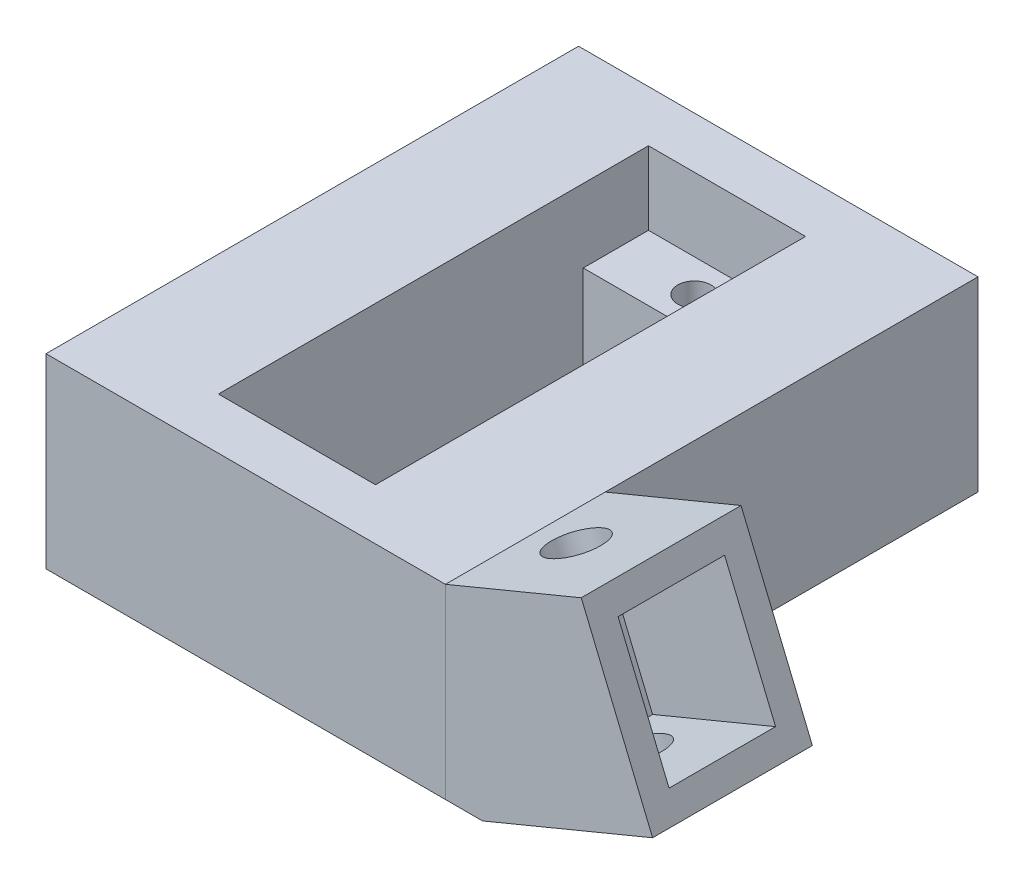
ISO-10303-21;
HEADER;
FILE_DESCRIPTION(('STEP AP214'),'2;1');
FILE_NAME('part.step','',(''),(''),'','','');
FILE_SCHEMA(('AUTOMOTIVE_DESIGN { 1 0 10303 214 1 1 1 1 }'));
ENDSEC;
DATA;
#1=APPLICATION_CONTEXT('core data for automotive mechanical design processes');
#2=APPLICATION_PROTOCOL_DEFINITION('international standard','automotive_design',2000,#1);
#3=PRODUCT_CONTEXT('',#1,'mechanical');
#4=PRODUCT('Part','Part','',(#3));
#5=PRODUCT_RELATED_PRODUCT_CATEGORY('part','',(#4));
#6=PRODUCT_DEFINITION_FORMATION('','',#4);
#7=PRODUCT_DEFINITION_CONTEXT('part definition',#1,'design');
#8=PRODUCT_DEFINITION('design','',#6,#7);
#9=PRODUCT_DEFINITION_SHAPE('','',#8);
#10=(LENGTH_UNIT() NAMED_UNIT(*) SI_UNIT(.MILLI.,.METRE.));
#11=(NAMED_UNIT(*) PLANE_ANGLE_UNIT() SI_UNIT($,.RADIAN.));
#12=(NAMED_UNIT(*) SI_UNIT($,.STERADIAN.) SOLID_ANGLE_UNIT());
#13=UNCERTAINTY_MEASURE_WITH_UNIT(LENGTH_MEASURE(1.E-05),#10,'distance_accuracy_value','');
#14=(GEOMETRIC_REPRESENTATION_CONTEXT(3) GLOBAL_UNCERTAINTY_ASSIGNED_CONTEXT((#13)) GLOBAL_UNIT_ASSIGNED_CONTEXT((#10,
#11,#12)) REPRESENTATION_CONTEXT('',''));
#15=CARTESIAN_POINT('',(0.,0.,0.));
#16=DIRECTION('',(0.,0.,1.));
#17=DIRECTION('',(1.,0.,0.));
#18=AXIS2_PLACEMENT_3D('',#15,#16,#17);
#19=CARTESIAN_POINT('',(6.59982399774752,24.7982922199653,34.));
#20=DIRECTION('',(0.382683432365084,-0.923879532511289,0.));
#21=DIRECTION('',(0.923879532511289,0.382683432365084,0.));
#22=AXIS2_PLACEMENT_3D('',#19,#20,#21);
#23=CYLINDRICAL_SURFACE('',#22,2.);
#24=CARTESIAN_POINT('',(17.0796064724433,-0.502140761165466,34.));
#25=DIRECTION('',(0.382683432365093,-0.923879532511286,0.));
#26=DIRECTION('',(0.923879532511286,0.382683432365093,0.));
#27=AXIS2_PLACEMENT_3D('',#24,#25,#26);
#28=CIRCLE('',#27,2.);
#29=CARTESIAN_POINT('',(18.9273655374658,0.263226103564719,34.));
#30=VERTEX_POINT('',#29);
#31=EDGE_CURVE('E52',#30,#30,#28,.F.);
#32=ORIENTED_EDGE('',*,*,#31,.T.);
#33=EDGE_LOOP('',(#32));
#34=FACE_BOUND('',#33,.T.);
#35=CARTESIAN_POINT('',(17.8449733371734,-2.34989982618799,34.));
#36=DIRECTION('',(0.382683432365084,-0.923879532511289,0.));
#37=DIRECTION('',(0.923879532511289,0.382683432365084,0.));
#38=AXIS2_PLACEMENT_3D('',#35,#36,#37);
#39=CIRCLE('',#38,2.);
#40=CARTESIAN_POINT('',(19.692732402196,-1.58453296145782,34.));
#41=VERTEX_POINT('',#40);
#42=EDGE_CURVE('E153',#41,#41,#39,.T.);
#43=ORIENTED_EDGE('',*,*,#42,.T.);
#44=EDGE_LOOP('',(#43));
#45=FACE_BOUND('',#44,.T.);
#46=ADVANCED_FACE('F48',(#34,#45),#23,.F.);
#47=CARTESIAN_POINT('',(24.2314403727898,0.295461435612971,28.));
#48=DIRECTION('',(0.382683432365084,-0.923879532511289,0.));
#49=DIRECTION('',(0.923879532511289,0.382683432365084,0.));
#50=AXIS2_PLACEMENT_3D('',#47,#48,#49);
#51=PLANE('',#50);
#52=ORIENTED_EDGE('',*,*,#42,.F.);
#53=EDGE_LOOP('',(#52));
#54=FACE_BOUND('',#53,.T.);
#55=DIRECTION('',(0.923879532511289,0.382683432365084,0.));
#56=VECTOR('',#55,1.);
#57=CARTESIAN_POINT('',(24.2314403727898,0.295461435612971,40.));
#58=LINE('',#57,#56);
#59=CARTESIAN_POINT('',(11.458506301557,-4.99526108798895,40.));
#60=VERTEX_POINT('',#59);
#61=CARTESIAN_POINT('',(24.2314403727898,0.295461435612971,40.));
#62=VERTEX_POINT('',#61);
#63=EDGE_CURVE('E146',#60,#62,#58,.T.);
#64=ORIENTED_EDGE('',*,*,#63,.F.);
#65=DIRECTION('',(0.,0.,1.));
#66=VECTOR('',#65,1.);
#67=CARTESIAN_POINT('',(11.458506301557,-4.99526108798895,28.));
#68=LINE('',#67,#66);
#69=CARTESIAN_POINT('',(11.458506301557,-4.99526108798895,28.));
#70=VERTEX_POINT('',#69);
#71=EDGE_CURVE('E57',#70,#60,#68,.T.);
#72=ORIENTED_EDGE('',*,*,#71,.F.);
#73=DIRECTION('',(0.923879532511289,0.382683432365084,0.));
#74=VECTOR('',#73,1.);
#75=CARTESIAN_POINT('',(24.2314403727898,0.295461435612971,28.));
#76=LINE('',#75,#74);
#77=CARTESIAN_POINT('',(24.2314403727898,0.295461435612971,28.));
#78=VERTEX_POINT('',#77);
#79=EDGE_CURVE('E128',#70,#78,#76,.T.);
#80=ORIENTED_EDGE('',*,*,#79,.T.);
#81=DIRECTION('',(0.,0.,1.));
#82=VECTOR('',#81,1.);
#83=CARTESIAN_POINT('',(24.2314403727898,0.295461435612971,28.));
#84=LINE('',#83,#82);
#85=EDGE_CURVE('E12',#78,#62,#84,.T.);
#86=ORIENTED_EDGE('',*,*,#85,.T.);
#87=EDGE_LOOP('',(#64,#72,#80,#86));
#88=FACE_BOUND('',#87,.T.);
#89=ADVANCED_FACE('F181',(#54,#88),#51,.T.);
#90=CARTESIAN_POINT('',(11.458506301557,-4.99526108798895,28.));
#91=DIRECTION('',(0.,-1.,0.));
#92=DIRECTION('',(1.,0.,0.));
#93=AXIS2_PLACEMENT_3D('',#90,#91,#92);
#94=PLANE('',#93);
#95=DIRECTION('',(1.,0.,0.));
#96=VECTOR('',#95,1.);
#97=CARTESIAN_POINT('',(11.458506301557,-4.99526108798895,40.));
#98=LINE('',#97,#96);
#99=CARTESIAN_POINT('',(8.67095256505801,-4.99526108798895,40.));
#100=VERTEX_POINT('',#99);
#101=EDGE_CURVE('E114',#100,#60,#98,.T.);
#102=ORIENTED_EDGE('',*,*,#101,.F.);
#103=DIRECTION('',(0.,0.,1.));
#104=VECTOR('',#103,1.);
#105=CARTESIAN_POINT('',(8.67095256505801,-4.99526108798895,28.));
#106=LINE('',#105,#104);
#107=CARTESIAN_POINT('',(8.67095256505801,-4.99526108798895,28.));
#108=VERTEX_POINT('',#107);
#109=EDGE_CURVE('E108',#108,#100,#106,.T.);
#110=ORIENTED_EDGE('',*,*,#109,.F.);
#111=DIRECTION('',(1.,0.,0.));
#112=VECTOR('',#111,1.);
#113=CARTESIAN_POINT('',(11.458506301557,-4.99526108798895,28.));
#114=LINE('',#113,#112);
#115=EDGE_CURVE('E111',#108,#70,#114,.T.);
#116=ORIENTED_EDGE('',*,*,#115,.T.);
#117=ORIENTED_EDGE('',*,*,#71,.T.);
#118=EDGE_LOOP('',(#102,#110,#116,#117));
#119=FACE_BOUND('',#118,.T.);
#120=ADVANCED_FACE('F110',(#119),#94,.T.);
#121=CARTESIAN_POINT('',(8.67095256505801,9.00358715260278,28.));
#122=DIRECTION('',(-1.,0.,0.));
#123=DIRECTION('',(0.,0.,1.));
#124=AXIS2_PLACEMENT_3D('',#121,#122,#123);
#125=PLANE('',#124);
#126=DIRECTION('',(0.,-1.,0.));
#127=VECTOR('',#126,1.);
#128=CARTESIAN_POINT('',(8.67095256505801,9.00358715260278,40.));
#129=LINE('',#128,#127);
#130=CARTESIAN_POINT('',(8.67095256505801,9.00358715260278,40.));
#131=VERTEX_POINT('',#130);
#132=EDGE_CURVE('E143',#131,#100,#129,.T.);
#133=ORIENTED_EDGE('',*,*,#132,.F.);
#134=DIRECTION('',(0.,0.,1.));
#135=VECTOR('',#134,1.);
#136=CARTESIAN_POINT('',(8.67095256505801,9.00358715260278,28.));
#137=LINE('',#136,#135);
#138=CARTESIAN_POINT('',(8.67095256505801,9.00358715260278,28.));
#139=VERTEX_POINT('',#138);
#140=EDGE_CURVE('E119',#139,#131,#137,.T.);
#141=ORIENTED_EDGE('',*,*,#140,.F.);
#142=DIRECTION('',(0.,-1.,0.));
#143=VECTOR('',#142,1.);
#144=CARTESIAN_POINT('',(8.67095256505801,9.00358715260278,28.));
#145=LINE('',#144,#143);
#146=EDGE_CURVE('E125',#139,#108,#145,.T.);
#147=ORIENTED_EDGE('',*,*,#146,.T.);
#148=ORIENTED_EDGE('',*,*,#109,.T.);
#149=EDGE_LOOP('',(#133,#141,#147,#148));
#150=FACE_BOUND('',#149,.T.);
#151=ADVANCED_FACE('F130',(#150),#125,.T.);
#152=CARTESIAN_POINT('',(18.8738723196785,13.229774890771,28.));
#153=DIRECTION('',(-0.382683432365093,0.923879532511285,0.));
#154=DIRECTION('',(-0.923879532511286,-0.382683432365093,0.));
#155=AXIS2_PLACEMENT_3D('',#152,#153,#154);
#156=PLANE('',#155);
#157=CARTESIAN_POINT('',(12.4874052840622,10.58441362897,34.));
#158=DIRECTION('',(-0.382683432365093,0.923879532511285,0.));
#159=DIRECTION('',(-0.923879532511286,-0.382683432365093,0.));
#160=AXIS2_PLACEMENT_3D('',#157,#158,#159);
#161=CIRCLE('',#160,2.);
#162=CARTESIAN_POINT('',(10.6396462190397,9.81904676423984,34.));
#163=VERTEX_POINT('',#162);
#164=EDGE_CURVE('E140',#163,#163,#161,.T.);
#165=ORIENTED_EDGE('',*,*,#164,.F.);
#166=EDGE_LOOP('',(#165));
#167=FACE_BOUND('',#166,.T.);
#168=DIRECTION('',(-0.923879532511285,-0.382683432365093,0.));
#169=VECTOR('',#168,1.);
#170=CARTESIAN_POINT('',(18.8738723196785,13.229774890771,40.));
#171=LINE('',#170,#169);
#172=CARTESIAN_POINT('',(18.8738723196785,13.229774890771,40.));
#173=VERTEX_POINT('',#172);
#174=EDGE_CURVE('E139',#173,#131,#171,.T.);
#175=ORIENTED_EDGE('',*,*,#174,.F.);
#176=DIRECTION('',(0.,0.,1.));
#177=VECTOR('',#176,1.);
#178=CARTESIAN_POINT('',(18.8738723196785,13.229774890771,28.));
#179=LINE('',#178,#177);
#180=CARTESIAN_POINT('',(18.8738723196785,13.229774890771,28.));
#181=VERTEX_POINT('',#180);
#182=EDGE_CURVE('E137',#181,#173,#179,.T.);
#183=ORIENTED_EDGE('',*,*,#182,.F.);
#184=DIRECTION('',(-0.923879532511285,-0.382683432365093,0.));
#185=VECTOR('',#184,1.);
#186=CARTESIAN_POINT('',(18.8738723196785,13.229774890771,28.));
#187=LINE('',#186,#185);
#188=EDGE_CURVE('E131',#181,#139,#187,.T.);
#189=ORIENTED_EDGE('',*,*,#188,.T.);
#190=ORIENTED_EDGE('',*,*,#140,.T.);
#191=EDGE_LOOP('',(#175,#183,#189,#190));
#192=FACE_BOUND('',#191,.T.);
#193=ADVANCED_FACE('F190',(#167,#192),#156,.T.);
#194=CARTESIAN_POINT('',(20.7872894815039,8.61037722821456,28.));
#195=DIRECTION('',(0.923879532511285,0.382683432365093,0.));
#196=DIRECTION('',(-0.382683432365093,0.923879532511286,0.));
#197=AXIS2_PLACEMENT_3D('',#194,#195,#196);
#198=PLANE('',#197);
#199=DIRECTION('',(-0.382683432365093,0.923879532511286,0.));
#200=VECTOR('',#199,1.);
#201=CARTESIAN_POINT('',(23.4660735080596,2.14322050063554,30.));
#202=LINE('',#201,#200);
#203=CARTESIAN_POINT('',(23.4660735080596,2.14322050063554,30.));
#204=VERTEX_POINT('',#203);
#205=CARTESIAN_POINT('',(19.6392391844087,11.3820158257484,30.));
#206=VERTEX_POINT('',#205);
#207=EDGE_CURVE('E65',#204,#206,#202,.T.);
#208=ORIENTED_EDGE('',*,*,#207,.F.);
#209=DIRECTION('',(0.,0.,-1.));
#210=VECTOR('',#209,1.);
#211=CARTESIAN_POINT('',(23.4660735080596,2.14322050063554,30.));
#212=LINE('',#211,#210);
#213=CARTESIAN_POINT('',(23.4660735080596,2.14322050063554,38.));
#214=VERTEX_POINT('',#213);
#215=EDGE_CURVE('E169',#214,#204,#212,.T.);
#216=ORIENTED_EDGE('',*,*,#215,.F.);
#217=DIRECTION('',(0.382683432365093,-0.923879532511286,0.));
#218=VECTOR('',#217,1.);
#219=CARTESIAN_POINT('',(23.4660735080596,2.14322050063554,38.));
#220=LINE('',#219,#218);
#221=CARTESIAN_POINT('',(19.6392391844087,11.3820158257484,38.));
#222=VERTEX_POINT('',#221);
#223=EDGE_CURVE('E328',#222,#214,#220,.T.);
#224=ORIENTED_EDGE('',*,*,#223,.F.);
#225=DIRECTION('',(0.,0.,1.));
#226=VECTOR('',#225,1.);
#227=CARTESIAN_POINT('',(19.6392391844087,11.3820158257484,30.));
#228=LINE('',#227,#226);
#229=EDGE_CURVE('E333',#206,#222,#228,.T.);
#230=ORIENTED_EDGE('',*,*,#229,.F.);
#231=EDGE_LOOP('',(#208,#216,#224,#230));
#232=FACE_BOUND('',#231,.T.);
#233=DIRECTION('',(-0.382683432365093,0.923879532511286,0.));
#234=VECTOR('',#233,1.);
#235=CARTESIAN_POINT('',(20.7872894815039,8.61037722821456,40.));
#236=LINE('',#235,#234);
#237=EDGE_CURVE('E94',#62,#173,#236,.T.);
#238=ORIENTED_EDGE('',*,*,#237,.F.);
#239=ORIENTED_EDGE('',*,*,#85,.F.);
#240=DIRECTION('',(-0.382683432365093,0.923879532511285,0.));
#241=VECTOR('',#240,1.);
#242=CARTESIAN_POINT('',(20.7872894815039,8.61037722821456,28.));
#243=LINE('',#242,#241);
#244=EDGE_CURVE('E97',#78,#181,#243,.T.);
#245=ORIENTED_EDGE('',*,*,#244,.T.);
#246=ORIENTED_EDGE('',*,*,#182,.T.);
#247=EDGE_LOOP('',(#238,#239,#245,#246));
#248=FACE_BOUND('',#247,.T.);
#249=ADVANCED_FACE('F50',(#232,#248),#198,.T.);
#250=CARTESIAN_POINT('',(0.,0.,28.));
#251=DIRECTION('',(0.,0.,-1.));
#252=DIRECTION('',(-1.,0.,0.));
#253=AXIS2_PLACEMENT_3D('',#250,#251,#252);
#254=PLANE('',#253);
#255=ORIENTED_EDGE('',*,*,#244,.F.);
#256=ORIENTED_EDGE('',*,*,#79,.F.);
#257=ORIENTED_EDGE('',*,*,#115,.F.);
#258=ORIENTED_EDGE('',*,*,#146,.F.);
#259=ORIENTED_EDGE('',*,*,#188,.F.);
#260=EDGE_LOOP('',(#255,#256,#257,#258,#259));
#261=FACE_BOUND('',#260,.T.);
#262=ADVANCED_FACE('F123',(#261),#254,.T.);
#263=CARTESIAN_POINT('',(0.,0.,40.));
#264=DIRECTION('',(0.,0.,-1.));
#265=DIRECTION('',(-1.,0.,0.));
#266=AXIS2_PLACEMENT_3D('',#263,#264,#265);
#267=PLANE('',#266);
#268=ORIENTED_EDGE('',*,*,#63,.T.);
#269=ORIENTED_EDGE('',*,*,#237,.T.);
#270=ORIENTED_EDGE('',*,*,#174,.T.);
#271=ORIENTED_EDGE('',*,*,#132,.T.);
#272=ORIENTED_EDGE('',*,*,#101,.T.);
#273=EDGE_LOOP('',(#268,#269,#270,#271,#272));
#274=FACE_BOUND('',#273,.T.);
#275=ADVANCED_FACE('F187',(#274),#267,.F.);
#276=CARTESIAN_POINT('',(13.2527721487924,8.73665456394744,34.));
#277=DIRECTION('',(-0.382683432365093,0.923879532511286,0.));
#278=DIRECTION('',(-0.923879532511286,-0.382683432365093,0.));
#279=AXIS2_PLACEMENT_3D('',#276,#277,#278);
#280=CIRCLE('',#279,2.);
#281=CARTESIAN_POINT('',(11.4050130837698,7.97128769921726,34.));
#282=VERTEX_POINT('',#281);
#283=EDGE_CURVE('E154',#282,#282,#280,.F.);
#284=ORIENTED_EDGE('',*,*,#283,.T.);
#285=EDGE_LOOP('',(#284));
#286=FACE_BOUND('',#285,.T.);
#287=ORIENTED_EDGE('',*,*,#164,.T.);
#288=EDGE_LOOP('',(#287));
#289=FACE_BOUND('',#288,.T.);
#290=ADVANCED_FACE('F204',(#286,#289),#23,.F.);
#291=CARTESIAN_POINT('',(14.2272781829467,-1.68361382301538,30.));
#292=DIRECTION('',(0.382683432365093,-0.923879532511286,0.));
#293=DIRECTION('',(0.923879532511286,0.382683432365093,0.));
#294=AXIS2_PLACEMENT_3D('',#291,#292,#293);
#295=PLANE('',#294);
#296=ORIENTED_EDGE('',*,*,#215,.T.);
#297=DIRECTION('',(0.923879532511286,0.382683432365093,0.));
#298=VECTOR('',#297,1.);
#299=CARTESIAN_POINT('',(14.2272781829467,-1.68361382301538,30.));
#300=LINE('',#299,#298);
#301=CARTESIAN_POINT('',(14.2272781829467,-1.68361382301538,30.));
#302=VERTEX_POINT('',#301);
#303=EDGE_CURVE('E156',#302,#204,#300,.T.);
#304=ORIENTED_EDGE('',*,*,#303,.F.);
#305=DIRECTION('',(0.,0.,-1.));
#306=VECTOR('',#305,1.);
#307=CARTESIAN_POINT('',(14.2272781829467,-1.68361382301538,30.));
#308=LINE('',#307,#306);
#309=CARTESIAN_POINT('',(14.2272781829467,-1.68361382301538,38.));
#310=VERTEX_POINT('',#309);
#311=EDGE_CURVE('E176',#310,#302,#308,.T.);
#312=ORIENTED_EDGE('',*,*,#311,.F.);
#313=DIRECTION('',(0.923879532511286,0.382683432365093,0.));
#314=VECTOR('',#313,1.);
#315=CARTESIAN_POINT('',(14.2272781829467,-1.68361382301538,38.));
#316=LINE('',#315,#314);
#317=EDGE_CURVE('E160',#310,#214,#316,.T.);
#318=ORIENTED_EDGE('',*,*,#317,.T.);
#319=EDGE_LOOP('',(#296,#304,#312,#318));
#320=FACE_BOUND('',#319,.T.);
#321=ORIENTED_EDGE('',*,*,#31,.F.);
#322=EDGE_LOOP('',(#321));
#323=FACE_BOUND('',#322,.T.);
#324=ADVANCED_FACE('F209',(#320,#323),#295,.F.);
#325=CARTESIAN_POINT('',(10.4004438592958,7.55518150209749,30.));
#326=DIRECTION('',(-0.382683432365093,0.923879532511286,0.));
#327=DIRECTION('',(-0.923879532511286,-0.382683432365093,0.));
#328=AXIS2_PLACEMENT_3D('',#325,#326,#327);
#329=PLANE('',#328);
#330=ORIENTED_EDGE('',*,*,#229,.T.);
#331=DIRECTION('',(0.923879532511286,0.382683432365093,0.));
#332=VECTOR('',#331,1.);
#333=CARTESIAN_POINT('',(10.4004438592958,7.55518150209749,38.));
#334=LINE('',#333,#332);
#335=CARTESIAN_POINT('',(10.4004438592958,7.55518150209749,38.));
#336=VERTEX_POINT('',#335);
#337=EDGE_CURVE('E166',#336,#222,#334,.T.);
#338=ORIENTED_EDGE('',*,*,#337,.F.);
#339=DIRECTION('',(0.,0.,1.));
#340=VECTOR('',#339,1.);
#341=CARTESIAN_POINT('',(10.4004438592958,7.55518150209749,30.));
#342=LINE('',#341,#340);
#343=CARTESIAN_POINT('',(10.4004438592958,7.55518150209749,30.));
#344=VERTEX_POINT('',#343);
#345=EDGE_CURVE('E322',#344,#336,#342,.T.);
#346=ORIENTED_EDGE('',*,*,#345,.F.);
#347=DIRECTION('',(0.923879532511286,0.382683432365093,0.));
#348=VECTOR('',#347,1.);
#349=CARTESIAN_POINT('',(10.4004438592958,7.55518150209749,30.));
#350=LINE('',#349,#348);
#351=EDGE_CURVE('E174',#344,#206,#350,.T.);
#352=ORIENTED_EDGE('',*,*,#351,.T.);
#353=EDGE_LOOP('',(#330,#338,#346,#352));
#354=FACE_BOUND('',#353,.T.);
#355=ORIENTED_EDGE('',*,*,#283,.F.);
#356=EDGE_LOOP('',(#355));
#357=FACE_BOUND('',#356,.T.);
#358=ADVANCED_FACE('F212',(#354,#357),#329,.F.);
#359=CARTESIAN_POINT('',(14.2272781829467,-1.68361382301538,30.));
#360=DIRECTION('',(0.,0.,-1.));
#361=DIRECTION('',(-1.,0.,0.));
#362=AXIS2_PLACEMENT_3D('',#359,#360,#361);
#363=PLANE('',#362);
#364=ORIENTED_EDGE('',*,*,#207,.T.);
#365=ORIENTED_EDGE('',*,*,#351,.F.);
#366=DIRECTION('',(-0.382683432365093,0.923879532511286,0.));
#367=VECTOR('',#366,1.);
#368=CARTESIAN_POINT('',(14.2272781829467,-1.68361382301538,30.));
#369=LINE('',#368,#367);
#370=EDGE_CURVE('E318',#302,#344,#369,.T.);
#371=ORIENTED_EDGE('',*,*,#370,.F.);
#372=ORIENTED_EDGE('',*,*,#303,.T.);
#373=EDGE_LOOP('',(#364,#365,#371,#372));
#374=FACE_BOUND('',#373,.T.);
#375=ADVANCED_FACE('F282',(#374),#363,.F.);
#376=CARTESIAN_POINT('',(14.2272781829467,-1.68361382301538,38.));
#377=DIRECTION('',(0.,0.,1.));
#378=DIRECTION('',(1.,0.,0.));
#379=AXIS2_PLACEMENT_3D('',#376,#377,#378);
#380=PLANE('',#379);
#381=ORIENTED_EDGE('',*,*,#223,.T.);
#382=ORIENTED_EDGE('',*,*,#317,.F.);
#383=DIRECTION('',(0.382683432365093,-0.923879532511286,0.));
#384=VECTOR('',#383,1.);
#385=CARTESIAN_POINT('',(14.2272781829467,-1.68361382301538,38.));
#386=LINE('',#385,#384);
#387=EDGE_CURVE('E326',#336,#310,#386,.T.);
#388=ORIENTED_EDGE('',*,*,#387,.F.);
#389=ORIENTED_EDGE('',*,*,#337,.T.);
#390=EDGE_LOOP('',(#381,#382,#388,#389));
#391=FACE_BOUND('',#390,.T.);
#392=ADVANCED_FACE('F291',(#391),#380,.F.);
#393=CARTESIAN_POINT('',(11.5484941563911,4.78354290456367,0.));
#394=DIRECTION('',(0.923879532511286,0.382683432365093,0.));
#395=DIRECTION('',(-0.382683432365093,0.923879532511286,0.));
#396=AXIS2_PLACEMENT_3D('',#393,#394,#395);
#397=PLANE('',#396);
#398=ORIENTED_EDGE('',*,*,#370,.T.);
#399=ORIENTED_EDGE('',*,*,#345,.T.);
#400=ORIENTED_EDGE('',*,*,#387,.T.);
#401=ORIENTED_EDGE('',*,*,#311,.T.);
#402=EDGE_LOOP('',(#398,#399,#400,#401));
#403=FACE_BOUND('',#402,.T.);
#404=ADVANCED_FACE('F298',(#403),#397,.T.);
#405=CLOSED_SHELL('',(#46,#89,#120,#151,#193,#249,#262,#275,#290,#324,#358,#375,#392,#404));
#406=MANIFOLD_SOLID_BREP('B2',#405);
#407=CARTESIAN_POINT('',(0.,3.50358715260278,0.));
#408=DIRECTION('',(0.,1.,0.));
#409=DIRECTION('',(0.,0.,1.));
#410=AXIS2_PLACEMENT_3D('',#407,#408,#409);
#411=PLANE('',#410);
#412=CARTESIAN_POINT('',(-6.32904743494199,3.50358715260278,33.7));
#413=DIRECTION('',(0.,1.,0.));
#414=DIRECTION('',(0.,0.,1.));
#415=AXIS2_PLACEMENT_3D('',#412,#413,#414);
#416=CIRCLE('',#415,1.25);
#417=CARTESIAN_POINT('',(-6.32904743494199,3.50358715260278,34.95));
#418=VERTEX_POINT('',#417);
#419=EDGE_CURVE('E478',#418,#418,#416,.T.);
#420=ORIENTED_EDGE('',*,*,#419,.F.);
#421=EDGE_LOOP('',(#420));
#422=FACE_BOUND('',#421,.T.);
#423=DIRECTION('',(1.,0.,0.));
#424=VECTOR('',#423,1.);
#425=CARTESIAN_POINT('',(-12.229047434942,3.50358715260278,31.25));
#426=LINE('',#425,#424);
#427=CARTESIAN_POINT('',(-12.229047434942,3.50358715260278,31.25));
#428=VERTEX_POINT('',#427);
#429=CARTESIAN_POINT('',(-0.429047434941994,3.50358715260278,31.25));
#430=VERTEX_POINT('',#429);
#431=EDGE_CURVE('E475',#428,#430,#426,.T.);
#432=ORIENTED_EDGE('',*,*,#431,.F.);
#433=DIRECTION('',(0.,0.,1.));
#434=VECTOR('',#433,1.);
#435=CARTESIAN_POINT('',(-12.229047434942,3.50358715260278,3.85));
#436=LINE('',#435,#434);
#437=CARTESIAN_POINT('',(-12.229047434942,3.50358715260278,36.15));
#438=VERTEX_POINT('',#437);
#439=EDGE_CURVE('E455',#428,#438,#436,.T.);
#440=ORIENTED_EDGE('',*,*,#439,.T.);
#441=DIRECTION('',(1.,0.,0.));
#442=VECTOR('',#441,1.);
#443=CARTESIAN_POINT('',(-12.229047434942,3.50358715260278,36.15));
#444=LINE('',#443,#442);
#445=CARTESIAN_POINT('',(-0.429047434941994,3.50358715260278,36.15));
#446=VERTEX_POINT('',#445);
#447=EDGE_CURVE('E500',#438,#446,#444,.T.);
#448=ORIENTED_EDGE('',*,*,#447,.T.);
#449=DIRECTION('',(0.,0.,-1.));
#450=VECTOR('',#449,1.);
#451=CARTESIAN_POINT('',(-0.429047434941994,3.50358715260278,3.85));
#452=LINE('',#451,#450);
#453=EDGE_CURVE('E505',#446,#430,#452,.T.);
#454=ORIENTED_EDGE('',*,*,#453,.T.);
#455=EDGE_LOOP('',(#432,#440,#448,#454));
#456=FACE_BOUND('',#455,.T.);
#457=ADVANCED_FACE('F356',(#422,#456),#411,.T.);
#458=CARTESIAN_POINT('',(8.67095256505801,9.00358715260278,40.));
#459=DIRECTION('',(1.,0.,0.));
#460=DIRECTION('',(0.,0.,-1.));
#461=AXIS2_PLACEMENT_3D('',#458,#459,#460);
#462=PLANE('',#461);
#463=DIRECTION('',(0.,-1.,0.));
#464=VECTOR('',#463,1.);
#465=CARTESIAN_POINT('',(8.67095256505801,9.00358715260278,0.));
#466=LINE('',#465,#464);
#467=CARTESIAN_POINT('',(8.67095256505801,9.00358715260278,0.));
#468=VERTEX_POINT('',#467);
#469=CARTESIAN_POINT('',(8.67095256505801,-4.99526108798895,0.));
#470=VERTEX_POINT('',#469);
#471=EDGE_CURVE('E531',#468,#470,#466,.T.);
#472=ORIENTED_EDGE('',*,*,#471,.F.);
#473=DIRECTION('',(0.,0.,-1.));
#474=VECTOR('',#473,1.);
#475=CARTESIAN_POINT('',(8.67095256505801,9.00358715260278,40.));
#476=LINE('',#475,#474);
#477=CARTESIAN_POINT('',(8.67095256505801,9.00358715260278,40.));
#478=VERTEX_POINT('',#477);
#479=EDGE_CURVE('E46',#478,#468,#476,.T.);
#480=ORIENTED_EDGE('',*,*,#479,.F.);
#481=DIRECTION('',(0.,-1.,0.));
#482=VECTOR('',#481,1.);
#483=CARTESIAN_POINT('',(8.67095256505801,9.00358715260278,40.));
#484=LINE('',#483,#482);
#485=CARTESIAN_POINT('',(8.67095256505801,-4.99526108798895,40.));
#486=VERTEX_POINT('',#485);
#487=EDGE_CURVE('E541',#478,#486,#484,.T.);
#488=ORIENTED_EDGE('',*,*,#487,.T.);
#489=DIRECTION('',(0.,0.,-1.));
#490=VECTOR('',#489,1.);
#491=CARTESIAN_POINT('',(8.67095256505801,-4.99526108798895,40.));
#492=LINE('',#491,#490);
#493=EDGE_CURVE('E360',#486,#470,#492,.T.);
#494=ORIENTED_EDGE('',*,*,#493,.T.);
#495=EDGE_LOOP('',(#472,#480,#488,#494));
#496=FACE_BOUND('',#495,.T.);
#497=ADVANCED_FACE('F358',(#496),#462,.T.);
#498=CARTESIAN_POINT('',(8.67095256505801,9.00358715260278,40.));
#499=DIRECTION('',(0.,-1.,0.));
#500=DIRECTION('',(0.,0.,-1.));
#501=AXIS2_PLACEMENT_3D('',#498,#499,#500);
#502=PLANE('',#501);
#503=DIRECTION('',(1.,0.,0.));
#504=VECTOR('',#503,1.);
#505=CARTESIAN_POINT('',(-12.229047434942,9.00358715260278,36.15));
#506=LINE('',#505,#504);
#507=CARTESIAN_POINT('',(-12.229047434942,9.00358715260278,36.15));
#508=VERTEX_POINT('',#507);
#509=CARTESIAN_POINT('',(-0.429047434941994,9.00358715260278,36.15));
#510=VERTEX_POINT('',#509);
#511=EDGE_CURVE('E516',#508,#510,#506,.T.);
#512=ORIENTED_EDGE('',*,*,#511,.F.);
#513=DIRECTION('',(0.,0.,1.));
#514=VECTOR('',#513,1.);
#515=CARTESIAN_POINT('',(-12.229047434942,9.00358715260278,3.85));
#516=LINE('',#515,#514);
#517=CARTESIAN_POINT('',(-12.229047434942,9.00358715260278,3.85));
#518=VERTEX_POINT('',#517);
#519=EDGE_CURVE('E491',#518,#508,#516,.T.);
#520=ORIENTED_EDGE('',*,*,#519,.F.);
#521=DIRECTION('',(-1.,0.,0.));
#522=VECTOR('',#521,1.);
#523=CARTESIAN_POINT('',(-12.229047434942,9.00358715260278,3.85));
#524=LINE('',#523,#522);
#525=CARTESIAN_POINT('',(-0.429047434941994,9.00358715260278,3.85));
#526=VERTEX_POINT('',#525);
#527=EDGE_CURVE('E524',#526,#518,#524,.T.);
#528=ORIENTED_EDGE('',*,*,#527,.F.);
#529=DIRECTION('',(0.,0.,-1.));
#530=VECTOR('',#529,1.);
#531=CARTESIAN_POINT('',(-0.429047434941994,9.00358715260278,3.85));
#532=LINE('',#531,#530);
#533=EDGE_CURVE('E520',#510,#526,#532,.T.);
#534=ORIENTED_EDGE('',*,*,#533,.F.);
#535=EDGE_LOOP('',(#512,#520,#528,#534));
#536=FACE_BOUND('',#535,.T.);
#537=DIRECTION('',(-1.,0.,0.));
#538=VECTOR('',#537,1.);
#539=CARTESIAN_POINT('',(8.67095256505801,9.00358715260278,0.));
#540=LINE('',#539,#538);
#541=CARTESIAN_POINT('',(-21.329047434942,9.00358715260278,0.));
#542=VERTEX_POINT('',#541);
#543=EDGE_CURVE('E546',#468,#542,#540,.T.);
#544=ORIENTED_EDGE('',*,*,#543,.T.);
#545=DIRECTION('',(0.,0.,-1.));
#546=VECTOR('',#545,1.);
#547=CARTESIAN_POINT('',(-21.329047434942,9.00358715260278,40.));
#548=LINE('',#547,#546);
#549=CARTESIAN_POINT('',(-21.329047434942,9.00358715260278,40.));
#550=VERTEX_POINT('',#549);
#551=EDGE_CURVE('E366',#550,#542,#548,.T.);
#552=ORIENTED_EDGE('',*,*,#551,.F.);
#553=DIRECTION('',(-1.,0.,0.));
#554=VECTOR('',#553,1.);
#555=CARTESIAN_POINT('',(-11.329047434942,9.00358715260278,40.));
#556=LINE('',#555,#554);
#557=EDGE_CURVE('E553',#478,#550,#556,.T.);
#558=ORIENTED_EDGE('',*,*,#557,.F.);
#559=ORIENTED_EDGE('',*,*,#479,.T.);
#560=EDGE_LOOP('',(#544,#552,#558,#559));
#561=FACE_BOUND('',#560,.T.);
#562=ADVANCED_FACE('F587',(#536,#561),#502,.F.);
#563=CARTESIAN_POINT('',(-21.329047434942,9.00358715260278,40.));
#564=DIRECTION('',(1.,0.,0.));
#565=DIRECTION('',(0.,0.,-1.));
#566=AXIS2_PLACEMENT_3D('',#563,#564,#565);
#567=PLANE('',#566);
#568=DIRECTION('',(0.,-1.,0.));
#569=VECTOR('',#568,1.);
#570=CARTESIAN_POINT('',(-21.329047434942,9.00358715260278,0.));
#571=LINE('',#570,#569);
#572=CARTESIAN_POINT('',(-21.329047434942,-4.99526108798895,0.));
#573=VERTEX_POINT('',#572);
#574=EDGE_CURVE('E562',#542,#573,#571,.T.);
#575=ORIENTED_EDGE('',*,*,#574,.T.);
#576=DIRECTION('',(0.,0.,-1.));
#577=VECTOR('',#576,1.);
#578=CARTESIAN_POINT('',(-21.329047434942,-4.99526108798895,40.));
#579=LINE('',#578,#577);
#580=CARTESIAN_POINT('',(-21.329047434942,-4.99526108798895,40.));
#581=VERTEX_POINT('',#580);
#582=EDGE_CURVE('E569',#581,#573,#579,.T.);
#583=ORIENTED_EDGE('',*,*,#582,.F.);
#584=DIRECTION('',(0.,-1.,0.));
#585=VECTOR('',#584,1.);
#586=CARTESIAN_POINT('',(-21.329047434942,9.00358715260278,40.));
#587=LINE('',#586,#585);
#588=EDGE_CURVE('E549',#550,#581,#587,.T.);
#589=ORIENTED_EDGE('',*,*,#588,.F.);
#590=ORIENTED_EDGE('',*,*,#551,.T.);
#591=EDGE_LOOP('',(#575,#583,#589,#590));
#592=FACE_BOUND('',#591,.T.);
#593=ADVANCED_FACE('F590',(#592),#567,.F.);
#594=CARTESIAN_POINT('',(-21.329047434942,-4.99526108798895,40.));
#595=DIRECTION('',(0.,1.,0.));
#596=DIRECTION('',(0.,0.,1.));
#597=AXIS2_PLACEMENT_3D('',#594,#595,#596);
#598=PLANE('',#597);
#599=CARTESIAN_POINT('',(-6.329047434942,-4.99526108798895,6.3));
#600=DIRECTION('',(0.,1.,0.));
#601=DIRECTION('',(0.,0.,1.));
#602=AXIS2_PLACEMENT_3D('',#599,#600,#601);
#603=CIRCLE('',#602,1.25);
#604=CARTESIAN_POINT('',(-6.329047434942,-4.99526108798895,7.55));
#605=VERTEX_POINT('',#604);
#606=EDGE_CURVE('E486',#605,#605,#603,.T.);
#607=ORIENTED_EDGE('',*,*,#606,.T.);
#608=EDGE_LOOP('',(#607));
#609=FACE_BOUND('',#608,.T.);
#610=CARTESIAN_POINT('',(-6.32904743494199,-4.99526108798895,33.7));
#611=DIRECTION('',(0.,1.,0.));
#612=DIRECTION('',(0.,0.,1.));
#613=AXIS2_PLACEMENT_3D('',#610,#611,#612);
#614=CIRCLE('',#613,1.25);
#615=CARTESIAN_POINT('',(-6.32904743494199,-4.99526108798895,34.95));
#616=VERTEX_POINT('',#615);
#617=EDGE_CURVE('E748',#616,#616,#614,.T.);
#618=ORIENTED_EDGE('',*,*,#617,.T.);
#619=EDGE_LOOP('',(#618));
#620=FACE_BOUND('',#619,.T.);
#621=DIRECTION('',(-1.,0.,0.));
#622=VECTOR('',#621,1.);
#623=CARTESIAN_POINT('',(-12.229047434942,-4.99526108798895,8.75));
#624=LINE('',#623,#622);
#625=CARTESIAN_POINT('',(-0.429047434941994,-4.99526108798895,8.75));
#626=VERTEX_POINT('',#625);
#627=CARTESIAN_POINT('',(-12.229047434942,-4.99526108798895,8.75));
#628=VERTEX_POINT('',#627);
#629=EDGE_CURVE('E461',#626,#628,#624,.T.);
#630=ORIENTED_EDGE('',*,*,#629,.T.);
#631=DIRECTION('',(0.,0.,1.));
#632=VECTOR('',#631,1.);
#633=CARTESIAN_POINT('',(-12.229047434942,-4.99526108798895,8.75));
#634=LINE('',#633,#632);
#635=CARTESIAN_POINT('',(-12.229047434942,-4.99526108798895,31.25));
#636=VERTEX_POINT('',#635);
#637=EDGE_CURVE('E452',#628,#636,#634,.T.);
#638=ORIENTED_EDGE('',*,*,#637,.T.);
#639=DIRECTION('',(1.,0.,0.));
#640=VECTOR('',#639,1.);
#641=CARTESIAN_POINT('',(-12.229047434942,-4.99526108798895,31.25));
#642=LINE('',#641,#640);
#643=CARTESIAN_POINT('',(-0.429047434941994,-4.99526108798895,31.25));
#644=VERTEX_POINT('',#643);
#645=EDGE_CURVE('E464',#636,#644,#642,.T.);
#646=ORIENTED_EDGE('',*,*,#645,.T.);
#647=DIRECTION('',(0.,0.,-1.));
#648=VECTOR('',#647,1.);
#649=CARTESIAN_POINT('',(-0.429047434941994,-4.99526108798895,8.75));
#650=LINE('',#649,#648);
#651=EDGE_CURVE('E381',#644,#626,#650,.T.);
#652=ORIENTED_EDGE('',*,*,#651,.T.);
#653=EDGE_LOOP('',(#630,#638,#646,#652));
#654=FACE_BOUND('',#653,.T.);
#655=DIRECTION('',(1.,0.,0.));
#656=VECTOR('',#655,1.);
#657=CARTESIAN_POINT('',(-21.329047434942,-4.99526108798895,0.));
#658=LINE('',#657,#656);
#659=EDGE_CURVE('E559',#573,#470,#658,.T.);
#660=ORIENTED_EDGE('',*,*,#659,.T.);
#661=ORIENTED_EDGE('',*,*,#493,.F.);
#662=DIRECTION('',(1.,0.,0.));
#663=VECTOR('',#662,1.);
#664=CARTESIAN_POINT('',(-11.329047434942,-4.99526108798895,40.));
#665=LINE('',#664,#663);
#666=EDGE_CURVE('E545',#581,#486,#665,.T.);
#667=ORIENTED_EDGE('',*,*,#666,.F.);
#668=ORIENTED_EDGE('',*,*,#582,.T.);
#669=EDGE_LOOP('',(#660,#661,#667,#668));
#670=FACE_BOUND('',#669,.T.);
#671=ADVANCED_FACE('F469',(#609,#620,#654,#670),#598,.F.);
#672=CARTESIAN_POINT('',(0.,0.,40.));
#673=DIRECTION('',(0.,0.,1.));
#674=DIRECTION('',(1.,0.,0.));
#675=AXIS2_PLACEMENT_3D('',#672,#673,#674);
#676=PLANE('',#675);
#677=ORIENTED_EDGE('',*,*,#487,.F.);
#678=ORIENTED_EDGE('',*,*,#557,.T.);
#679=ORIENTED_EDGE('',*,*,#588,.T.);
#680=ORIENTED_EDGE('',*,*,#666,.T.);
#681=EDGE_LOOP('',(#677,#678,#679,#680));
#682=FACE_BOUND('',#681,.T.);
#683=ADVANCED_FACE('F592',(#682),#676,.T.);
#684=CARTESIAN_POINT('',(0.,0.,0.));
#685=DIRECTION('',(0.,0.,1.));
#686=DIRECTION('',(1.,0.,0.));
#687=AXIS2_PLACEMENT_3D('',#684,#685,#686);
#688=PLANE('',#687);
#689=ORIENTED_EDGE('',*,*,#471,.T.);
#690=ORIENTED_EDGE('',*,*,#659,.F.);
#691=ORIENTED_EDGE('',*,*,#574,.F.);
#692=ORIENTED_EDGE('',*,*,#543,.F.);
#693=EDGE_LOOP('',(#689,#690,#691,#692));
#694=FACE_BOUND('',#693,.T.);
#695=ADVANCED_FACE('F583',(#694),#688,.F.);
#696=CARTESIAN_POINT('',(-12.229047434942,3.50358715260278,3.85));
#697=DIRECTION('',(-1.,0.,0.));
#698=DIRECTION('',(0.,0.,1.));
#699=AXIS2_PLACEMENT_3D('',#696,#697,#698);
#700=PLANE('',#699);
#701=ORIENTED_EDGE('',*,*,#519,.T.);
#702=DIRECTION('',(0.,1.,0.));
#703=VECTOR('',#702,1.);
#704=CARTESIAN_POINT('',(-12.229047434942,3.50358715260278,36.15));
#705=LINE('',#704,#703);
#706=EDGE_CURVE('E513',#438,#508,#705,.T.);
#707=ORIENTED_EDGE('',*,*,#706,.F.);
#708=ORIENTED_EDGE('',*,*,#439,.F.);
#709=DIRECTION('',(0.,1.,0.));
#710=VECTOR('',#709,1.);
#711=CARTESIAN_POINT('',(-12.229047434942,-4.99526108798895,31.25));
#712=LINE('',#711,#710);
#713=EDGE_CURVE('E448',#636,#428,#712,.T.);
#714=ORIENTED_EDGE('',*,*,#713,.F.);
#715=ORIENTED_EDGE('',*,*,#637,.F.);
#716=DIRECTION('',(0.,1.,0.));
#717=VECTOR('',#716,1.);
#718=CARTESIAN_POINT('',(-12.229047434942,-4.99526108798895,8.75));
#719=LINE('',#718,#717);
#720=CARTESIAN_POINT('',(-12.229047434942,3.50358715260278,8.75));
#721=VERTEX_POINT('',#720);
#722=EDGE_CURVE('E488',#628,#721,#719,.T.);
#723=ORIENTED_EDGE('',*,*,#722,.T.);
#724=CARTESIAN_POINT('',(-12.229047434942,3.50358715260278,3.85));
#725=VERTEX_POINT('',#724);
#726=EDGE_CURVE('E496',#725,#721,#436,.T.);
#727=ORIENTED_EDGE('',*,*,#726,.F.);
#728=DIRECTION('',(0.,1.,0.));
#729=VECTOR('',#728,1.);
#730=CARTESIAN_POINT('',(-12.229047434942,3.50358715260278,3.85));
#731=LINE('',#730,#729);
#732=EDGE_CURVE('E528',#725,#518,#731,.T.);
#733=ORIENTED_EDGE('',*,*,#732,.T.);
#734=EDGE_LOOP('',(#701,#707,#708,#714,#715,#723,#727,#733));
#735=FACE_BOUND('',#734,.T.);
#736=ADVANCED_FACE('F450',(#735),#700,.F.);
#737=CARTESIAN_POINT('',(-12.229047434942,3.50358715260278,3.85));
#738=DIRECTION('',(0.,0.,-1.));
#739=DIRECTION('',(-1.,0.,0.));
#740=AXIS2_PLACEMENT_3D('',#737,#738,#739);
#741=PLANE('',#740);
#742=ORIENTED_EDGE('',*,*,#527,.T.);
#743=ORIENTED_EDGE('',*,*,#732,.F.);
#744=DIRECTION('',(-1.,0.,0.));
#745=VECTOR('',#744,1.);
#746=CARTESIAN_POINT('',(-12.229047434942,3.50358715260278,3.85));
#747=LINE('',#746,#745);
#748=CARTESIAN_POINT('',(-0.429047434941994,3.50358715260278,3.85));
#749=VERTEX_POINT('',#748);
#750=EDGE_CURVE('E509',#749,#725,#747,.T.);
#751=ORIENTED_EDGE('',*,*,#750,.F.);
#752=DIRECTION('',(0.,1.,0.));
#753=VECTOR('',#752,1.);
#754=CARTESIAN_POINT('',(-0.429047434941994,3.50358715260278,3.85));
#755=LINE('',#754,#753);
#756=EDGE_CURVE('E532',#749,#526,#755,.T.);
#757=ORIENTED_EDGE('',*,*,#756,.T.);
#758=EDGE_LOOP('',(#742,#743,#751,#757));
#759=FACE_BOUND('',#758,.T.);
#760=ADVANCED_FACE('F644',(#759),#741,.F.);
#761=CARTESIAN_POINT('',(-0.429047434941994,3.50358715260278,3.85));
#762=DIRECTION('',(1.,0.,0.));
#763=DIRECTION('',(0.,0.,-1.));
#764=AXIS2_PLACEMENT_3D('',#761,#762,#763);
#765=PLANE('',#764);
#766=ORIENTED_EDGE('',*,*,#533,.T.);
#767=ORIENTED_EDGE('',*,*,#756,.F.);
#768=CARTESIAN_POINT('',(-0.429047434941994,3.50358715260278,8.75));
#769=VERTEX_POINT('',#768);
#770=EDGE_CURVE('E504',#769,#749,#452,.T.);
#771=ORIENTED_EDGE('',*,*,#770,.F.);
#772=DIRECTION('',(0.,1.,0.));
#773=VECTOR('',#772,1.);
#774=CARTESIAN_POINT('',(-0.429047434941994,-4.99526108798895,8.75));
#775=LINE('',#774,#773);
#776=EDGE_CURVE('E374',#626,#769,#775,.T.);
#777=ORIENTED_EDGE('',*,*,#776,.F.);
#778=ORIENTED_EDGE('',*,*,#651,.F.);
#779=DIRECTION('',(0.,1.,0.));
#780=VECTOR('',#779,1.);
#781=CARTESIAN_POINT('',(-0.429047434941994,-4.99526108798895,31.25));
#782=LINE('',#781,#780);
#783=EDGE_CURVE('E460',#644,#430,#782,.T.);
#784=ORIENTED_EDGE('',*,*,#783,.T.);
#785=ORIENTED_EDGE('',*,*,#453,.F.);
#786=DIRECTION('',(0.,1.,0.));
#787=VECTOR('',#786,1.);
#788=CARTESIAN_POINT('',(-0.429047434941994,3.50358715260278,36.15));
#789=LINE('',#788,#787);
#790=EDGE_CURVE('E535',#446,#510,#789,.T.);
#791=ORIENTED_EDGE('',*,*,#790,.T.);
#792=EDGE_LOOP('',(#766,#767,#771,#777,#778,#784,#785,#791));
#793=FACE_BOUND('',#792,.T.);
#794=ADVANCED_FACE('F623',(#793),#765,.F.);
#795=CARTESIAN_POINT('',(-12.229047434942,3.50358715260278,36.15));
#796=DIRECTION('',(0.,0.,1.));
#797=DIRECTION('',(1.,0.,0.));
#798=AXIS2_PLACEMENT_3D('',#795,#796,#797);
#799=PLANE('',#798);
#800=ORIENTED_EDGE('',*,*,#511,.T.);
#801=ORIENTED_EDGE('',*,*,#790,.F.);
#802=ORIENTED_EDGE('',*,*,#447,.F.);
#803=ORIENTED_EDGE('',*,*,#706,.T.);
#804=EDGE_LOOP('',(#800,#801,#802,#803));
#805=FACE_BOUND('',#804,.T.);
#806=ADVANCED_FACE('F616',(#805),#799,.F.);
#807=CARTESIAN_POINT('',(-6.329047434942,3.50358715260278,6.3));
#808=DIRECTION('',(0.,1.,0.));
#809=DIRECTION('',(0.,0.,1.));
#810=AXIS2_PLACEMENT_3D('',#807,#808,#809);
#811=CIRCLE('',#810,1.25);
#812=CARTESIAN_POINT('',(-6.329047434942,3.50358715260278,7.55));
#813=VERTEX_POINT('',#812);
#814=EDGE_CURVE('E629',#813,#813,#811,.T.);
#815=ORIENTED_EDGE('',*,*,#814,.F.);
#816=EDGE_LOOP('',(#815));
#817=FACE_BOUND('',#816,.T.);
#818=DIRECTION('',(-1.,0.,0.));
#819=VECTOR('',#818,1.);
#820=CARTESIAN_POINT('',(-12.229047434942,3.50358715260278,8.75));
#821=LINE('',#820,#819);
#822=EDGE_CURVE('E472',#769,#721,#821,.T.);
#823=ORIENTED_EDGE('',*,*,#822,.F.);
#824=ORIENTED_EDGE('',*,*,#770,.T.);
#825=ORIENTED_EDGE('',*,*,#750,.T.);
#826=ORIENTED_EDGE('',*,*,#726,.T.);
#827=EDGE_LOOP('',(#823,#824,#825,#826));
#828=FACE_BOUND('',#827,.T.);
#829=ADVANCED_FACE('F606',(#817,#828),#411,.T.);
#830=CARTESIAN_POINT('',(-12.229047434942,-4.99526108798895,8.75));
#831=DIRECTION('',(0.,0.,-1.));
#832=DIRECTION('',(-1.,0.,0.));
#833=AXIS2_PLACEMENT_3D('',#830,#831,#832);
#834=PLANE('',#833);
#835=ORIENTED_EDGE('',*,*,#822,.T.);
#836=ORIENTED_EDGE('',*,*,#722,.F.);
#837=ORIENTED_EDGE('',*,*,#629,.F.);
#838=ORIENTED_EDGE('',*,*,#776,.T.);
#839=EDGE_LOOP('',(#835,#836,#837,#838));
#840=FACE_BOUND('',#839,.T.);
#841=ADVANCED_FACE('F615',(#840),#834,.F.);
#842=CARTESIAN_POINT('',(-12.229047434942,-4.99526108798895,31.25));
#843=DIRECTION('',(0.,0.,1.));
#844=DIRECTION('',(1.,0.,0.));
#845=AXIS2_PLACEMENT_3D('',#842,#843,#844);
#846=PLANE('',#845);
#847=ORIENTED_EDGE('',*,*,#431,.T.);
#848=ORIENTED_EDGE('',*,*,#783,.F.);
#849=ORIENTED_EDGE('',*,*,#645,.F.);
#850=ORIENTED_EDGE('',*,*,#713,.T.);
#851=EDGE_LOOP('',(#847,#848,#849,#850));
#852=FACE_BOUND('',#851,.T.);
#853=ADVANCED_FACE('F465',(#852),#846,.F.);
#854=CARTESIAN_POINT('',(-6.329047434942,-4.99526108798895,6.3));
#855=DIRECTION('',(0.,1.,0.));
#856=DIRECTION('',(0.,0.,1.));
#857=AXIS2_PLACEMENT_3D('',#854,#855,#856);
#858=CYLINDRICAL_SURFACE('',#857,1.25);
#859=ORIENTED_EDGE('',*,*,#606,.F.);
#860=EDGE_LOOP('',(#859));
#861=FACE_BOUND('',#860,.T.);
#862=ORIENTED_EDGE('',*,*,#814,.T.);
#863=EDGE_LOOP('',(#862));
#864=FACE_BOUND('',#863,.T.);
#865=ADVANCED_FACE('F712',(#861,#864),#858,.F.);
#866=CARTESIAN_POINT('',(-6.32904743494199,-4.99526108798895,33.7));
#867=DIRECTION('',(0.,1.,0.));
#868=DIRECTION('',(0.,0.,1.));
#869=AXIS2_PLACEMENT_3D('',#866,#867,#868);
#870=CYLINDRICAL_SURFACE('',#869,1.25);
#871=ORIENTED_EDGE('',*,*,#617,.F.);
#872=EDGE_LOOP('',(#871));
#873=FACE_BOUND('',#872,.T.);
#874=ORIENTED_EDGE('',*,*,#419,.T.);
#875=EDGE_LOOP('',(#874));
#876=FACE_BOUND('',#875,.T.);
#877=ADVANCED_FACE('F731',(#873,#876),#870,.F.);
#878=CLOSED_SHELL('',(#457,#497,#562,#593,#671,#683,#695,#736,#760,#794,#806,#829,#841,#853,
#865,#877));
#879=MANIFOLD_SOLID_BREP('B6',#878);
#880=ADVANCED_BREP_SHAPE_REPRESENTATION('',(#18,#406,#879),#14);
#881=SHAPE_DEFINITION_REPRESENTATION(#9,#880);
ENDSEC;
END-ISO-10303-21;
